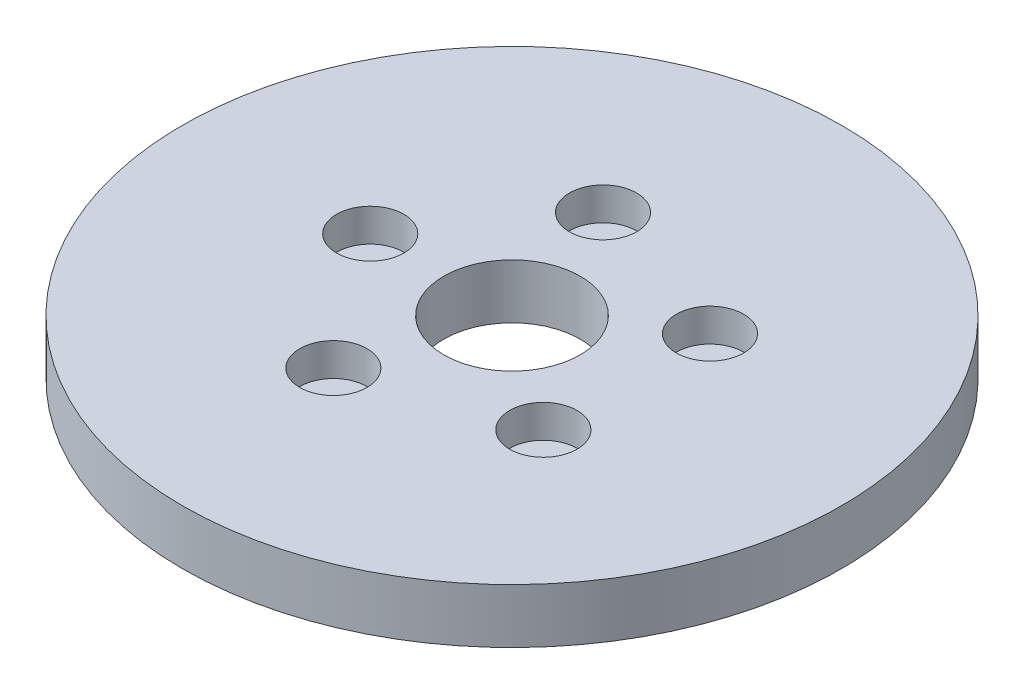
ISO-10303-21;
HEADER;
FILE_DESCRIPTION(('STEP AP214'),'2;1');
FILE_NAME('part.step','',(''),(''),'','','');
FILE_SCHEMA(('AUTOMOTIVE_DESIGN { 1 0 10303 214 1 1 1 1 }'));
ENDSEC;
DATA;
#1=APPLICATION_CONTEXT('core data for automotive mechanical design processes');
#2=APPLICATION_PROTOCOL_DEFINITION('international standard','automotive_design',2000,#1);
#3=PRODUCT_CONTEXT('',#1,'mechanical');
#4=PRODUCT('Part','Part','',(#3));
#5=PRODUCT_RELATED_PRODUCT_CATEGORY('part','',(#4));
#6=PRODUCT_DEFINITION_FORMATION('','',#4);
#7=PRODUCT_DEFINITION_CONTEXT('part definition',#1,'design');
#8=PRODUCT_DEFINITION('design','',#6,#7);
#9=PRODUCT_DEFINITION_SHAPE('','',#8);
#10=(LENGTH_UNIT() NAMED_UNIT(*) SI_UNIT(.MILLI.,.METRE.));
#11=(NAMED_UNIT(*) PLANE_ANGLE_UNIT() SI_UNIT($,.RADIAN.));
#12=(NAMED_UNIT(*) SI_UNIT($,.STERADIAN.) SOLID_ANGLE_UNIT());
#13=UNCERTAINTY_MEASURE_WITH_UNIT(LENGTH_MEASURE(1.E-05),#10,'distance_accuracy_value','');
#14=(GEOMETRIC_REPRESENTATION_CONTEXT(3) GLOBAL_UNCERTAINTY_ASSIGNED_CONTEXT((#13)) GLOBAL_UNIT_ASSIGNED_CONTEXT((#10,
#11,#12)) REPRESENTATION_CONTEXT('',''));
#15=CARTESIAN_POINT('',(0.,0.,0.));
#16=DIRECTION('',(0.,0.,1.));
#17=DIRECTION('',(1.,0.,0.));
#18=AXIS2_PLACEMENT_3D('',#15,#16,#17);
#19=CARTESIAN_POINT('',(0.,12.,0.));
#20=DIRECTION('',(0.,-1.,0.));
#21=DIRECTION('',(0.,0.,-1.));
#22=AXIS2_PLACEMENT_3D('',#19,#20,#21);
#23=CYLINDRICAL_SURFACE('',#22,72.5);
#24=CARTESIAN_POINT('',(0.,12.,0.));
#25=DIRECTION('',(0.,1.,0.));
#26=DIRECTION('',(0.,0.,1.));
#27=AXIS2_PLACEMENT_3D('',#24,#25,#26);
#28=CIRCLE('',#27,72.5);
#29=CARTESIAN_POINT('',(0.,12.,72.5));
#30=VERTEX_POINT('',#29);
#31=EDGE_CURVE('E10',#30,#30,#28,.T.);
#32=ORIENTED_EDGE('',*,*,#31,.F.);
#33=EDGE_LOOP('',(#32));
#34=FACE_BOUND('',#33,.T.);
#35=CARTESIAN_POINT('',(0.,0.,0.));
#36=DIRECTION('',(0.,1.,0.));
#37=DIRECTION('',(0.,0.,1.));
#38=AXIS2_PLACEMENT_3D('',#35,#36,#37);
#39=CIRCLE('',#38,72.5);
#40=CARTESIAN_POINT('',(0.,0.,72.5));
#41=VERTEX_POINT('',#40);
#42=EDGE_CURVE('E37',#41,#41,#39,.T.);
#43=ORIENTED_EDGE('',*,*,#42,.T.);
#44=EDGE_LOOP('',(#43));
#45=FACE_BOUND('',#44,.T.);
#46=ADVANCED_FACE('F40',(#34,#45),#23,.T.);
#47=CARTESIAN_POINT('',(0.,12.,0.));
#48=DIRECTION('',(0.,1.,0.));
#49=DIRECTION('',(0.,0.,1.));
#50=AXIS2_PLACEMENT_3D('',#47,#48,#49);
#51=PLANE('',#50);
#52=CARTESIAN_POINT('',(-9.63688965466625,12.,-29.6592966397397));
#53=DIRECTION('',(0.,1.,0.));
#54=DIRECTION('',(-0.95105651629515,0.,0.309016994374958));
#55=AXIS2_PLACEMENT_3D('',#52,#53,#54);
#56=CIRCLE('',#55,7.40254560795158);
#57=CARTESIAN_POINT('',(-16.6771288922806,12.,-27.3717842452469));
#58=VERTEX_POINT('',#57);
#59=EDGE_CURVE('E70',#58,#58,#56,.T.);
#60=ORIENTED_EDGE('',*,*,#59,.F.);
#61=EDGE_LOOP('',(#60));
#62=FACE_BOUND('',#61,.T.);
#63=CARTESIAN_POINT('',(25.2297046617474,12.,-18.330453405775));
#64=DIRECTION('',(0.,1.,0.));
#65=DIRECTION('',(-0.58778525229248,0.,-0.809016994374942));
#66=AXIS2_PLACEMENT_3D('',#63,#64,#65);
#67=CIRCLE('',#66,7.40254560795158);
#68=CARTESIAN_POINT('',(20.878597523971,12.,-24.3192386042434));
#69=VERTEX_POINT('',#68);
#70=EDGE_CURVE('E71',#69,#69,#67,.T.);
#71=ORIENTED_EDGE('',*,*,#70,.F.);
#72=EDGE_LOOP('',(#71));
#73=FACE_BOUND('',#72,.T.);
#74=CARTESIAN_POINT('',(25.2297046617477,12.,18.3304534057746));
#75=DIRECTION('',(0.,1.,0.));
#76=DIRECTION('',(0.587785252292469,0.,-0.809016994374951));
#77=AXIS2_PLACEMENT_3D('',#74,#75,#76);
#78=CIRCLE('',#77,7.40254560795158);
#79=CARTESIAN_POINT('',(29.580811799524,12.,12.3416682073061));
#80=VERTEX_POINT('',#79);
#81=EDGE_CURVE('E78',#80,#80,#78,.T.);
#82=ORIENTED_EDGE('',*,*,#81,.F.);
#83=EDGE_LOOP('',(#82));
#84=FACE_BOUND('',#83,.T.);
#85=CARTESIAN_POINT('',(-9.63688965466583,12.,29.6592966397398));
#86=DIRECTION('',(0.,1.,0.));
#87=DIRECTION('',(0.951056516295155,0.,0.309016994374945));
#88=AXIS2_PLACEMENT_3D('',#85,#86,#87);
#89=CIRCLE('',#88,7.40254560795158);
#90=CARTESIAN_POINT('',(-2.59665041705141,12.,31.9468090342325));
#91=VERTEX_POINT('',#90);
#92=EDGE_CURVE('E61',#91,#91,#89,.T.);
#93=ORIENTED_EDGE('',*,*,#92,.F.);
#94=EDGE_LOOP('',(#93));
#95=FACE_BOUND('',#94,.T.);
#96=CARTESIAN_POINT('',(-31.1856300141634,12.,0.));
#97=DIRECTION('',(0.,1.,0.));
#98=DIRECTION('',(0.,0.,1.));
#99=AXIS2_PLACEMENT_3D('',#96,#97,#98);
#100=CIRCLE('',#99,7.40254560795158);
#101=CARTESIAN_POINT('',(-31.1856300141634,12.,7.40254560795158));
#102=VERTEX_POINT('',#101);
#103=EDGE_CURVE('E54',#102,#102,#100,.T.);
#104=ORIENTED_EDGE('',*,*,#103,.F.);
#105=EDGE_LOOP('',(#104));
#106=FACE_BOUND('',#105,.T.);
#107=CARTESIAN_POINT('',(0.,12.,0.));
#108=DIRECTION('',(0.,1.,0.));
#109=DIRECTION('',(0.,0.,1.));
#110=AXIS2_PLACEMENT_3D('',#107,#108,#109);
#111=CIRCLE('',#110,15.);
#112=CARTESIAN_POINT('',(0.,12.,15.));
#113=VERTEX_POINT('',#112);
#114=EDGE_CURVE('E50',#113,#113,#111,.T.);
#115=ORIENTED_EDGE('',*,*,#114,.F.);
#116=EDGE_LOOP('',(#115));
#117=FACE_BOUND('',#116,.T.);
#118=ORIENTED_EDGE('',*,*,#31,.T.);
#119=EDGE_LOOP('',(#118));
#120=FACE_BOUND('',#119,.T.);
#121=ADVANCED_FACE('F94',(#62,#73,#84,#95,#106,#117,#120),#51,.T.);
#122=CARTESIAN_POINT('',(0.,0.,0.));
#123=DIRECTION('',(0.,1.,0.));
#124=DIRECTION('',(0.,0.,1.));
#125=AXIS2_PLACEMENT_3D('',#122,#123,#124);
#126=PLANE('',#125);
#127=CARTESIAN_POINT('',(0.,0.,0.));
#128=DIRECTION('',(0.,1.,0.));
#129=DIRECTION('',(0.,0.,1.));
#130=AXIS2_PLACEMENT_3D('',#127,#128,#129);
#131=CIRCLE('',#130,15.);
#132=CARTESIAN_POINT('',(0.,0.,15.));
#133=VERTEX_POINT('',#132);
#134=EDGE_CURVE('E47',#133,#133,#131,.T.);
#135=ORIENTED_EDGE('',*,*,#134,.T.);
#136=EDGE_LOOP('',(#135));
#137=FACE_BOUND('',#136,.T.);
#138=ORIENTED_EDGE('',*,*,#42,.F.);
#139=EDGE_LOOP('',(#138));
#140=FACE_BOUND('',#139,.T.);
#141=ADVANCED_FACE('F100',(#137,#140),#126,.F.);
#142=CARTESIAN_POINT('',(0.,12.,0.));
#143=DIRECTION('',(0.,-1.,0.));
#144=DIRECTION('',(0.,0.,-1.));
#145=AXIS2_PLACEMENT_3D('',#142,#143,#144);
#146=CYLINDRICAL_SURFACE('',#145,15.);
#147=ORIENTED_EDGE('',*,*,#114,.T.);
#148=EDGE_LOOP('',(#147));
#149=FACE_BOUND('',#148,.T.);
#150=ORIENTED_EDGE('',*,*,#134,.F.);
#151=EDGE_LOOP('',(#150));
#152=FACE_BOUND('',#151,.T.);
#153=ADVANCED_FACE('F106',(#149,#152),#146,.F.);
#154=CARTESIAN_POINT('',(-31.1856300141634,4.77702154248873,0.));
#155=DIRECTION('',(0.,1.,0.));
#156=DIRECTION('',(0.,0.,1.));
#157=AXIS2_PLACEMENT_3D('',#154,#155,#156);
#158=CYLINDRICAL_SURFACE('',#157,7.40254560795158);
#159=CARTESIAN_POINT('',(-31.1856300141634,4.77702154248873,0.));
#160=DIRECTION('',(0.,1.,0.));
#161=DIRECTION('',(0.,0.,1.));
#162=AXIS2_PLACEMENT_3D('',#159,#160,#161);
#163=CIRCLE('',#162,7.40254560795158);
#164=CARTESIAN_POINT('',(-31.1856300141634,4.77702154248873,7.40254560795158));
#165=VERTEX_POINT('',#164);
#166=EDGE_CURVE('E55',#165,#165,#163,.T.);
#167=ORIENTED_EDGE('',*,*,#166,.F.);
#168=EDGE_LOOP('',(#167));
#169=FACE_BOUND('',#168,.T.);
#170=ORIENTED_EDGE('',*,*,#103,.T.);
#171=EDGE_LOOP('',(#170));
#172=FACE_BOUND('',#171,.T.);
#173=ADVANCED_FACE('F108',(#169,#172),#158,.F.);
#174=CARTESIAN_POINT('',(-31.1856300141634,4.77702154248873,0.));
#175=DIRECTION('',(0.,1.,0.));
#176=DIRECTION('',(0.,0.,1.));
#177=AXIS2_PLACEMENT_3D('',#174,#175,#176);
#178=PLANE('',#177);
#179=ORIENTED_EDGE('',*,*,#166,.T.);
#180=EDGE_LOOP('',(#179));
#181=FACE_BOUND('',#180,.T.);
#182=ADVANCED_FACE('F138',(#181),#178,.T.);
#183=CARTESIAN_POINT('',(-9.63688965466583,4.77702154248873,29.6592966397398));
#184=DIRECTION('',(0.,1.,0.));
#185=DIRECTION('',(0.,0.,1.));
#186=AXIS2_PLACEMENT_3D('',#183,#184,#185);
#187=CYLINDRICAL_SURFACE('',#186,7.40254560795158);
#188=CARTESIAN_POINT('',(-9.63688965466583,4.77702154248873,29.6592966397398));
#189=DIRECTION('',(0.,1.,0.));
#190=DIRECTION('',(0.951056516295155,0.,0.309016994374945));
#191=AXIS2_PLACEMENT_3D('',#188,#189,#190);
#192=CIRCLE('',#191,7.40254560795158);
#193=CARTESIAN_POINT('',(-2.59665041705141,4.77702154248873,31.9468090342325));
#194=VERTEX_POINT('',#193);
#195=EDGE_CURVE('E59',#194,#194,#192,.T.);
#196=ORIENTED_EDGE('',*,*,#195,.F.);
#197=EDGE_LOOP('',(#196));
#198=FACE_BOUND('',#197,.T.);
#199=ORIENTED_EDGE('',*,*,#92,.T.);
#200=EDGE_LOOP('',(#199));
#201=FACE_BOUND('',#200,.T.);
#202=ADVANCED_FACE('F150',(#198,#201),#187,.F.);
#203=CARTESIAN_POINT('',(-9.63688965466583,4.77702154248873,29.6592966397398));
#204=DIRECTION('',(0.,1.,0.));
#205=DIRECTION('',(0.951056516295155,0.,0.309016994374945));
#206=AXIS2_PLACEMENT_3D('',#203,#204,#205);
#207=PLANE('',#206);
#208=ORIENTED_EDGE('',*,*,#195,.T.);
#209=EDGE_LOOP('',(#208));
#210=FACE_BOUND('',#209,.T.);
#211=ADVANCED_FACE('F89',(#210),#207,.T.);
#212=CARTESIAN_POINT('',(25.2297046617477,4.77702154248873,18.3304534057746));
#213=DIRECTION('',(0.,1.,0.));
#214=DIRECTION('',(0.,0.,1.));
#215=AXIS2_PLACEMENT_3D('',#212,#213,#214);
#216=CYLINDRICAL_SURFACE('',#215,7.40254560795158);
#217=CARTESIAN_POINT('',(25.2297046617477,4.77702154248873,18.3304534057746));
#218=DIRECTION('',(0.,1.,0.));
#219=DIRECTION('',(0.587785252292469,0.,-0.809016994374951));
#220=AXIS2_PLACEMENT_3D('',#217,#218,#219);
#221=CIRCLE('',#220,7.40254560795158);
#222=CARTESIAN_POINT('',(29.580811799524,4.77702154248873,12.3416682073061));
#223=VERTEX_POINT('',#222);
#224=EDGE_CURVE('E63',#223,#223,#221,.T.);
#225=ORIENTED_EDGE('',*,*,#224,.F.);
#226=EDGE_LOOP('',(#225));
#227=FACE_BOUND('',#226,.T.);
#228=ORIENTED_EDGE('',*,*,#81,.T.);
#229=EDGE_LOOP('',(#228));
#230=FACE_BOUND('',#229,.T.);
#231=ADVANCED_FACE('F87',(#227,#230),#216,.F.);
#232=CARTESIAN_POINT('',(25.2297046617477,4.77702154248873,18.3304534057746));
#233=DIRECTION('',(0.,1.,0.));
#234=DIRECTION('',(0.587785252292469,0.,-0.809016994374951));
#235=AXIS2_PLACEMENT_3D('',#232,#233,#234);
#236=PLANE('',#235);
#237=ORIENTED_EDGE('',*,*,#224,.T.);
#238=EDGE_LOOP('',(#237));
#239=FACE_BOUND('',#238,.T.);
#240=ADVANCED_FACE('F84',(#239),#236,.T.);
#241=CARTESIAN_POINT('',(25.2297046617474,4.77702154248873,-18.330453405775));
#242=DIRECTION('',(0.,1.,0.));
#243=DIRECTION('',(0.,0.,1.));
#244=AXIS2_PLACEMENT_3D('',#241,#242,#243);
#245=CYLINDRICAL_SURFACE('',#244,7.40254560795158);
#246=CARTESIAN_POINT('',(25.2297046617474,4.77702154248873,-18.330453405775));
#247=DIRECTION('',(0.,1.,0.));
#248=DIRECTION('',(-0.58778525229248,0.,-0.809016994374942));
#249=AXIS2_PLACEMENT_3D('',#246,#247,#248);
#250=CIRCLE('',#249,7.40254560795158);
#251=CARTESIAN_POINT('',(20.878597523971,4.77702154248873,-24.3192386042434));
#252=VERTEX_POINT('',#251);
#253=EDGE_CURVE('E76',#252,#252,#250,.T.);
#254=ORIENTED_EDGE('',*,*,#253,.F.);
#255=EDGE_LOOP('',(#254));
#256=FACE_BOUND('',#255,.T.);
#257=ORIENTED_EDGE('',*,*,#70,.T.);
#258=EDGE_LOOP('',(#257));
#259=FACE_BOUND('',#258,.T.);
#260=ADVANCED_FACE('F185',(#256,#259),#245,.F.);
#261=CARTESIAN_POINT('',(25.2297046617474,4.77702154248873,-18.330453405775));
#262=DIRECTION('',(0.,1.,0.));
#263=DIRECTION('',(-0.58778525229248,0.,-0.809016994374942));
#264=AXIS2_PLACEMENT_3D('',#261,#262,#263);
#265=PLANE('',#264);
#266=ORIENTED_EDGE('',*,*,#253,.T.);
#267=EDGE_LOOP('',(#266));
#268=FACE_BOUND('',#267,.T.);
#269=ADVANCED_FACE('F189',(#268),#265,.T.);
#270=CARTESIAN_POINT('',(-9.63688965466625,4.77702154248873,-29.6592966397397));
#271=DIRECTION('',(0.,1.,0.));
#272=DIRECTION('',(0.,0.,1.));
#273=AXIS2_PLACEMENT_3D('',#270,#271,#272);
#274=CYLINDRICAL_SURFACE('',#273,7.40254560795158);
#275=CARTESIAN_POINT('',(-9.63688965466625,4.77702154248873,-29.6592966397397));
#276=DIRECTION('',(0.,1.,0.));
#277=DIRECTION('',(-0.95105651629515,0.,0.309016994374958));
#278=AXIS2_PLACEMENT_3D('',#275,#276,#277);
#279=CIRCLE('',#278,7.40254560795158);
#280=CARTESIAN_POINT('',(-16.6771288922806,4.77702154248873,-27.3717842452469));
#281=VERTEX_POINT('',#280);
#282=EDGE_CURVE('E69',#281,#281,#279,.T.);
#283=ORIENTED_EDGE('',*,*,#282,.F.);
#284=EDGE_LOOP('',(#283));
#285=FACE_BOUND('',#284,.T.);
#286=ORIENTED_EDGE('',*,*,#59,.T.);
#287=EDGE_LOOP('',(#286));
#288=FACE_BOUND('',#287,.T.);
#289=ADVANCED_FACE('F200',(#285,#288),#274,.F.);
#290=CARTESIAN_POINT('',(-9.63688965466625,4.77702154248873,-29.6592966397397));
#291=DIRECTION('',(0.,1.,0.));
#292=DIRECTION('',(-0.95105651629515,0.,0.309016994374958));
#293=AXIS2_PLACEMENT_3D('',#290,#291,#292);
#294=PLANE('',#293);
#295=ORIENTED_EDGE('',*,*,#282,.T.);
#296=EDGE_LOOP('',(#295));
#297=FACE_BOUND('',#296,.T.);
#298=ADVANCED_FACE('F208',(#297),#294,.T.);
#299=CLOSED_SHELL('',(#46,#121,#141,#153,#173,#182,#202,#211,#231,#240,#260,#269,#289,#298));
#300=MANIFOLD_SOLID_BREP('B2',#299);
#301=ADVANCED_BREP_SHAPE_REPRESENTATION('',(#18,#300),#14);
#302=SHAPE_DEFINITION_REPRESENTATION(#9,#301);
ENDSEC;
END-ISO-10303-21;
